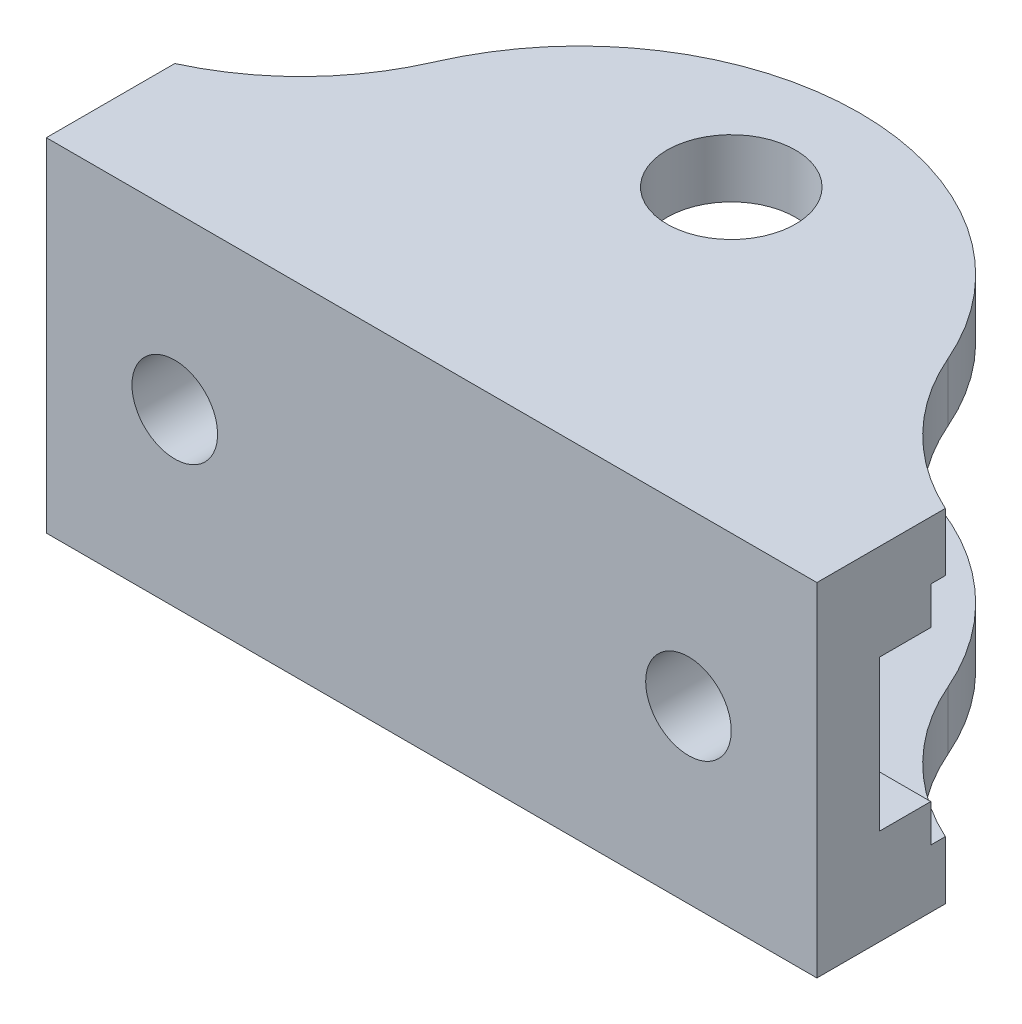
ISO-10303-21;
HEADER;
FILE_DESCRIPTION(('STEP AP214'),'2;1');
FILE_NAME('part.step','',(''),(''),'','','');
FILE_SCHEMA(('AUTOMOTIVE_DESIGN { 1 0 10303 214 1 1 1 1 }'));
ENDSEC;
DATA;
#1=APPLICATION_CONTEXT('core data for automotive mechanical design processes');
#2=APPLICATION_PROTOCOL_DEFINITION('international standard','automotive_design',2000,#1);
#3=PRODUCT_CONTEXT('',#1,'mechanical');
#4=PRODUCT('Part','Part','',(#3));
#5=PRODUCT_RELATED_PRODUCT_CATEGORY('part','',(#4));
#6=PRODUCT_DEFINITION_FORMATION('','',#4);
#7=PRODUCT_DEFINITION_CONTEXT('part definition',#1,'design');
#8=PRODUCT_DEFINITION('design','',#6,#7);
#9=PRODUCT_DEFINITION_SHAPE('','',#8);
#10=(LENGTH_UNIT() NAMED_UNIT(*) SI_UNIT(.MILLI.,.METRE.));
#11=(NAMED_UNIT(*) PLANE_ANGLE_UNIT() SI_UNIT($,.RADIAN.));
#12=(NAMED_UNIT(*) SI_UNIT($,.STERADIAN.) SOLID_ANGLE_UNIT());
#13=UNCERTAINTY_MEASURE_WITH_UNIT(LENGTH_MEASURE(1.E-05),#10,'distance_accuracy_value','');
#14=(GEOMETRIC_REPRESENTATION_CONTEXT(3) GLOBAL_UNCERTAINTY_ASSIGNED_CONTEXT((#13)) GLOBAL_UNIT_ASSIGNED_CONTEXT((#10,
#11,#12)) REPRESENTATION_CONTEXT('',''));
#15=CARTESIAN_POINT('',(0.,0.,0.));
#16=DIRECTION('',(0.,0.,1.));
#17=DIRECTION('',(1.,0.,0.));
#18=AXIS2_PLACEMENT_3D('',#15,#16,#17);
#19=CARTESIAN_POINT('',(-28.575,12.7,-38.1));
#20=DIRECTION('',(1.,0.,0.));
#21=DIRECTION('',(0.,0.,1.));
#22=AXIS2_PLACEMENT_3D('',#19,#20,#21);
#23=PLANE('',#22);
#24=DIRECTION('',(0.,1.,0.));
#25=VECTOR('',#24,1.);
#26=CARTESIAN_POINT('',(-28.575,-12.7000000000001,-9.525));
#27=LINE('',#26,#25);
#28=CARTESIAN_POINT('',(-28.575,8.382,-9.525));
#29=VERTEX_POINT('',#28);
#30=CARTESIAN_POINT('',(-28.575,12.6999999999999,-9.525));
#31=VERTEX_POINT('',#30);
#32=EDGE_CURVE('E154',#29,#31,#27,.T.);
#33=ORIENTED_EDGE('',*,*,#32,.F.);
#34=DIRECTION('',(0.,0.,-1.));
#35=VECTOR('',#34,1.);
#36=CARTESIAN_POINT('',(-28.575,8.382,54.9224901944315));
#37=LINE('',#36,#35);
#38=CARTESIAN_POINT('',(-28.575,8.382,-8.4455));
#39=VERTEX_POINT('',#38);
#40=EDGE_CURVE('E217',#39,#29,#37,.T.);
#41=ORIENTED_EDGE('',*,*,#40,.F.);
#42=DIRECTION('',(0.,-1.,0.));
#43=VECTOR('',#42,1.);
#44=CARTESIAN_POINT('',(-28.575,8.382,-8.4455));
#45=LINE('',#44,#43);
#46=CARTESIAN_POINT('',(-28.575,5.588,-8.44549999999997));
#47=VERTEX_POINT('',#46);
#48=EDGE_CURVE('E210',#39,#47,#45,.T.);
#49=ORIENTED_EDGE('',*,*,#48,.T.);
#50=DIRECTION('',(0.,0.,-1.));
#51=VECTOR('',#50,1.);
#52=CARTESIAN_POINT('',(-28.575,5.588,58.2325121903563));
#53=LINE('',#52,#51);
#54=CARTESIAN_POINT('',(-28.575,5.588,-4.63549999999999));
#55=VERTEX_POINT('',#54);
#56=EDGE_CURVE('E239',#55,#47,#53,.T.);
#57=ORIENTED_EDGE('',*,*,#56,.F.);
#58=DIRECTION('',(0.,-1.,0.));
#59=VECTOR('',#58,1.);
#60=CARTESIAN_POINT('',(-28.575,5.588,-4.63549999999999));
#61=LINE('',#60,#59);
#62=CARTESIAN_POINT('',(-28.575,-5.588,-4.63549999999999));
#63=VERTEX_POINT('',#62);
#64=EDGE_CURVE('E235',#55,#63,#61,.T.);
#65=ORIENTED_EDGE('',*,*,#64,.T.);
#66=DIRECTION('',(0.,0.,-1.));
#67=VECTOR('',#66,1.);
#68=CARTESIAN_POINT('',(-28.575,-5.588,58.2325121903563));
#69=LINE('',#68,#67);
#70=CARTESIAN_POINT('',(-28.575,-5.588,-8.4455));
#71=VERTEX_POINT('',#70);
#72=EDGE_CURVE('E238',#63,#71,#69,.T.);
#73=ORIENTED_EDGE('',*,*,#72,.T.);
#74=CARTESIAN_POINT('',(-28.575,-8.382,-8.4455));
#75=VERTEX_POINT('',#74);
#76=EDGE_CURVE('E214',#71,#75,#45,.T.);
#77=ORIENTED_EDGE('',*,*,#76,.T.);
#78=DIRECTION('',(0.,0.,-1.));
#79=VECTOR('',#78,1.);
#80=CARTESIAN_POINT('',(-28.575,-8.382,54.9224901944315));
#81=LINE('',#80,#79);
#82=CARTESIAN_POINT('',(-28.575,-8.382,-9.525));
#83=VERTEX_POINT('',#82);
#84=EDGE_CURVE('E213',#75,#83,#81,.T.);
#85=ORIENTED_EDGE('',*,*,#84,.T.);
#86=CARTESIAN_POINT('',(-28.575,-12.7000000000001,-9.525));
#87=VERTEX_POINT('',#86);
#88=EDGE_CURVE('E188',#87,#83,#27,.T.);
#89=ORIENTED_EDGE('',*,*,#88,.F.);
#90=DIRECTION('',(0.,0.,1.));
#91=VECTOR('',#90,1.);
#92=CARTESIAN_POINT('',(-28.575,-12.7,-38.1));
#93=LINE('',#92,#91);
#94=CARTESIAN_POINT('',(-28.575,-12.7,0.));
#95=VERTEX_POINT('',#94);
#96=EDGE_CURVE('E168',#87,#95,#93,.T.);
#97=ORIENTED_EDGE('',*,*,#96,.T.);
#98=DIRECTION('',(0.,-1.,0.));
#99=VECTOR('',#98,1.);
#100=CARTESIAN_POINT('',(-28.575,12.7,0.));
#101=LINE('',#100,#99);
#102=CARTESIAN_POINT('',(-28.575,12.7,0.));
#103=VERTEX_POINT('',#102);
#104=EDGE_CURVE('E264',#103,#95,#101,.T.);
#105=ORIENTED_EDGE('',*,*,#104,.F.);
#106=DIRECTION('',(0.,0.,1.));
#107=VECTOR('',#106,1.);
#108=CARTESIAN_POINT('',(-28.575,12.7,-38.1));
#109=LINE('',#108,#107);
#110=EDGE_CURVE('E280',#31,#103,#109,.T.);
#111=ORIENTED_EDGE('',*,*,#110,.F.);
#112=EDGE_LOOP('',(#33,#41,#49,#57,#65,#73,#77,#85,#89,#97,#105,#111));
#113=FACE_BOUND('',#112,.T.);
#114=ADVANCED_FACE('F36',(#113),#23,.F.);
#115=CARTESIAN_POINT('',(28.575,12.7,0.));
#116=DIRECTION('',(0.,0.,1.));
#117=DIRECTION('',(-1.,0.,0.));
#118=AXIS2_PLACEMENT_3D('',#115,#116,#117);
#119=PLANE('',#118);
#120=CARTESIAN_POINT('',(19.05,0.,0.));
#121=DIRECTION('',(0.,0.,1.));
#122=DIRECTION('',(1.,0.,0.));
#123=AXIS2_PLACEMENT_3D('',#120,#121,#122);
#124=CIRCLE('',#123,3.175);
#125=CARTESIAN_POINT('',(15.875,0.,0.));
#126=VERTEX_POINT('',#125);
#127=EDGE_CURVE('E261',#126,#126,#124,.T.);
#128=ORIENTED_EDGE('',*,*,#127,.F.);
#129=EDGE_LOOP('',(#128));
#130=FACE_BOUND('',#129,.T.);
#131=ORIENTED_EDGE('',*,*,#104,.T.);
#132=DIRECTION('',(1.,0.,0.));
#133=VECTOR('',#132,1.);
#134=CARTESIAN_POINT('',(28.575,-12.7,0.));
#135=LINE('',#134,#133);
#136=CARTESIAN_POINT('',(28.575,-12.7,0.));
#137=VERTEX_POINT('',#136);
#138=EDGE_CURVE('E267',#95,#137,#135,.T.);
#139=ORIENTED_EDGE('',*,*,#138,.T.);
#140=DIRECTION('',(0.,1.,0.));
#141=VECTOR('',#140,1.);
#142=CARTESIAN_POINT('',(28.575,12.7,0.));
#143=LINE('',#142,#141);
#144=CARTESIAN_POINT('',(28.575,12.7,0.));
#145=VERTEX_POINT('',#144);
#146=EDGE_CURVE('E270',#137,#145,#143,.T.);
#147=ORIENTED_EDGE('',*,*,#146,.T.);
#148=DIRECTION('',(-1.,0.,0.));
#149=VECTOR('',#148,1.);
#150=CARTESIAN_POINT('',(22.225,12.7,0.));
#151=LINE('',#150,#149);
#152=EDGE_CURVE('E273',#145,#103,#151,.T.);
#153=ORIENTED_EDGE('',*,*,#152,.T.);
#154=EDGE_LOOP('',(#131,#139,#147,#153));
#155=FACE_BOUND('',#154,.T.);
#156=CARTESIAN_POINT('',(-19.05,0.,0.));
#157=DIRECTION('',(0.,0.,1.));
#158=DIRECTION('',(1.,0.,0.));
#159=AXIS2_PLACEMENT_3D('',#156,#157,#158);
#160=CIRCLE('',#159,3.175);
#161=CARTESIAN_POINT('',(-22.225,0.,0.));
#162=VERTEX_POINT('',#161);
#163=EDGE_CURVE('E258',#162,#162,#160,.T.);
#164=ORIENTED_EDGE('',*,*,#163,.F.);
#165=EDGE_LOOP('',(#164));
#166=FACE_BOUND('',#165,.T.);
#167=ADVANCED_FACE('F304',(#130,#155,#166),#119,.T.);
#168=CARTESIAN_POINT('',(28.575,-12.7,-38.1));
#169=DIRECTION('',(0.,1.,0.));
#170=DIRECTION('',(-1.,0.,0.));
#171=AXIS2_PLACEMENT_3D('',#168,#169,#170);
#172=PLANE('',#171);
#173=CARTESIAN_POINT('',(0.,-12.7,-22.225));
#174=DIRECTION('',(0.,-1.,0.));
#175=DIRECTION('',(-1.,0.,0.));
#176=AXIS2_PLACEMENT_3D('',#173,#174,#175);
#177=CIRCLE('',#176,4.7625);
#178=CARTESIAN_POINT('',(-4.76249999999999,-12.7,-22.225));
#179=VERTEX_POINT('',#178);
#180=EDGE_CURVE('E198',#179,#179,#177,.T.);
#181=ORIENTED_EDGE('',*,*,#180,.F.);
#182=EDGE_LOOP('',(#181));
#183=FACE_BOUND('',#182,.T.);
#184=DIRECTION('',(0.,0.,1.));
#185=VECTOR('',#184,1.);
#186=CARTESIAN_POINT('',(28.575,-12.7,-38.1));
#187=LINE('',#186,#185);
#188=CARTESIAN_POINT('',(28.575,-12.7,-9.525));
#189=VERTEX_POINT('',#188);
#190=EDGE_CURVE('E277',#189,#137,#187,.T.);
#191=ORIENTED_EDGE('',*,*,#190,.T.);
#192=ORIENTED_EDGE('',*,*,#138,.F.);
#193=ORIENTED_EDGE('',*,*,#96,.F.);
#194=CARTESIAN_POINT('',(-36.5247503499917,-12.7000000000001,-26.8369602983835));
#195=DIRECTION('',(0.,-1.,0.));
#196=DIRECTION('',(-1.,0.,0.));
#197=AXIS2_PLACEMENT_3D('',#194,#195,#196);
#198=CIRCLE('',#197,19.05);
#199=CARTESIAN_POINT('',(-19.05,-12.7000000000001,-19.2517378095262));
#200=VERTEX_POINT('',#199);
#201=EDGE_CURVE('E150',#87,#200,#198,.F.);
#202=ORIENTED_EDGE('',*,*,#201,.T.);
#203=CARTESIAN_POINT('',(0.,-12.7000000000001,-10.9827505268095));
#204=DIRECTION('',(0.,-1.,0.));
#205=DIRECTION('',(-1.,0.,0.));
#206=AXIS2_PLACEMENT_3D('',#203,#204,#205);
#207=CIRCLE('',#206,20.7672494731905);
#208=CARTESIAN_POINT('',(19.05,-12.7000000000001,-19.2517378095262));
#209=VERTEX_POINT('',#208);
#210=EDGE_CURVE('E158',#200,#209,#207,.T.);
#211=ORIENTED_EDGE('',*,*,#210,.T.);
#212=CARTESIAN_POINT('',(36.5247503499917,-12.7,-26.8369602983835));
#213=DIRECTION('',(0.,-1.,0.));
#214=DIRECTION('',(-1.,0.,0.));
#215=AXIS2_PLACEMENT_3D('',#212,#213,#214);
#216=CIRCLE('',#215,19.05);
#217=EDGE_CURVE('E170',#189,#209,#216,.T.);
#218=ORIENTED_EDGE('',*,*,#217,.F.);
#219=EDGE_LOOP('',(#191,#192,#193,#202,#211,#218));
#220=FACE_BOUND('',#219,.T.);
#221=ADVANCED_FACE('F166',(#183,#220),#172,.F.);
#222=CARTESIAN_POINT('',(28.575,12.7,-38.1));
#223=DIRECTION('',(-1.,0.,0.));
#224=DIRECTION('',(0.,0.,-1.));
#225=AXIS2_PLACEMENT_3D('',#222,#223,#224);
#226=PLANE('',#225);
#227=DIRECTION('',(0.,0.,1.));
#228=VECTOR('',#227,1.);
#229=CARTESIAN_POINT('',(28.575,12.7,-38.1));
#230=LINE('',#229,#228);
#231=CARTESIAN_POINT('',(28.575,12.7,-9.525));
#232=VERTEX_POINT('',#231);
#233=EDGE_CURVE('E275',#232,#145,#230,.T.);
#234=ORIENTED_EDGE('',*,*,#233,.T.);
#235=ORIENTED_EDGE('',*,*,#146,.F.);
#236=ORIENTED_EDGE('',*,*,#190,.F.);
#237=DIRECTION('',(0.,1.,0.));
#238=VECTOR('',#237,1.);
#239=CARTESIAN_POINT('',(28.575,-12.7,-9.525));
#240=LINE('',#239,#238);
#241=CARTESIAN_POINT('',(28.575,-8.38199999999999,-9.525));
#242=VERTEX_POINT('',#241);
#243=EDGE_CURVE('E184',#189,#242,#240,.T.);
#244=ORIENTED_EDGE('',*,*,#243,.T.);
#245=DIRECTION('',(0.,0.,-1.));
#246=VECTOR('',#245,1.);
#247=CARTESIAN_POINT('',(28.575,-8.38199999999999,54.9224901944315));
#248=LINE('',#247,#246);
#249=CARTESIAN_POINT('',(28.575,-8.38199999999999,-8.44549999999997));
#250=VERTEX_POINT('',#249);
#251=EDGE_CURVE('E209',#250,#242,#248,.T.);
#252=ORIENTED_EDGE('',*,*,#251,.F.);
#253=DIRECTION('',(0.,1.,0.));
#254=VECTOR('',#253,1.);
#255=CARTESIAN_POINT('',(28.575,8.38199999999999,-8.4455));
#256=LINE('',#255,#254);
#257=CARTESIAN_POINT('',(28.575,-5.58799999999999,-8.44549999999997));
#258=VERTEX_POINT('',#257);
#259=EDGE_CURVE('E219',#250,#258,#256,.T.);
#260=ORIENTED_EDGE('',*,*,#259,.T.);
#261=DIRECTION('',(0.,0.,-1.));
#262=VECTOR('',#261,1.);
#263=CARTESIAN_POINT('',(28.575,-5.58799999999999,58.2325121903563));
#264=LINE('',#263,#262);
#265=CARTESIAN_POINT('',(28.575,-5.58799999999999,-4.63549999999999));
#266=VERTEX_POINT('',#265);
#267=EDGE_CURVE('E234',#266,#258,#264,.T.);
#268=ORIENTED_EDGE('',*,*,#267,.F.);
#269=DIRECTION('',(0.,1.,0.));
#270=VECTOR('',#269,1.);
#271=CARTESIAN_POINT('',(28.575,5.58799999999999,-4.63549999999999));
#272=LINE('',#271,#270);
#273=CARTESIAN_POINT('',(28.575,5.58799999999999,-4.63549999999999));
#274=VERTEX_POINT('',#273);
#275=EDGE_CURVE('E243',#266,#274,#272,.T.);
#276=ORIENTED_EDGE('',*,*,#275,.T.);
#277=DIRECTION('',(0.,0.,-1.));
#278=VECTOR('',#277,1.);
#279=CARTESIAN_POINT('',(28.575,5.58799999999999,58.2325121903563));
#280=LINE('',#279,#278);
#281=CARTESIAN_POINT('',(28.575,5.58799999999999,-8.4455));
#282=VERTEX_POINT('',#281);
#283=EDGE_CURVE('E242',#274,#282,#280,.T.);
#284=ORIENTED_EDGE('',*,*,#283,.T.);
#285=CARTESIAN_POINT('',(28.575,8.38199999999999,-8.4455));
#286=VERTEX_POINT('',#285);
#287=EDGE_CURVE('E222',#282,#286,#256,.T.);
#288=ORIENTED_EDGE('',*,*,#287,.T.);
#289=DIRECTION('',(0.,0.,-1.));
#290=VECTOR('',#289,1.);
#291=CARTESIAN_POINT('',(28.575,8.38199999999999,54.9224901944315));
#292=LINE('',#291,#290);
#293=CARTESIAN_POINT('',(28.575,8.38199999999999,-9.525));
#294=VERTEX_POINT('',#293);
#295=EDGE_CURVE('E218',#286,#294,#292,.T.);
#296=ORIENTED_EDGE('',*,*,#295,.T.);
#297=EDGE_CURVE('E187',#294,#232,#240,.T.);
#298=ORIENTED_EDGE('',*,*,#297,.T.);
#299=EDGE_LOOP('',(#234,#235,#236,#244,#252,#260,#268,#276,#284,#288,#296,#298));
#300=FACE_BOUND('',#299,.T.);
#301=ADVANCED_FACE('F299',(#300),#226,.F.);
#302=CARTESIAN_POINT('',(22.225,12.7,-38.1));
#303=DIRECTION('',(0.,-1.,0.));
#304=DIRECTION('',(1.,0.,0.));
#305=AXIS2_PLACEMENT_3D('',#302,#303,#304);
#306=PLANE('',#305);
#307=CARTESIAN_POINT('',(0.,12.7,-22.225));
#308=DIRECTION('',(0.,-1.,0.));
#309=DIRECTION('',(-1.,0.,0.));
#310=AXIS2_PLACEMENT_3D('',#307,#308,#309);
#311=CIRCLE('',#310,4.7625);
#312=CARTESIAN_POINT('',(-4.76250000000001,12.7,-22.225));
#313=VERTEX_POINT('',#312);
#314=EDGE_CURVE('E197',#313,#313,#311,.T.);
#315=ORIENTED_EDGE('',*,*,#314,.T.);
#316=EDGE_LOOP('',(#315));
#317=FACE_BOUND('',#316,.T.);
#318=CARTESIAN_POINT('',(0.,12.7,-10.9827505268095));
#319=DIRECTION('',(0.,-1.,0.));
#320=DIRECTION('',(-1.,0.,0.));
#321=AXIS2_PLACEMENT_3D('',#318,#319,#320);
#322=CIRCLE('',#321,20.7672494731905);
#323=CARTESIAN_POINT('',(-19.05,12.7,-19.2517378095262));
#324=VERTEX_POINT('',#323);
#325=CARTESIAN_POINT('',(19.05,12.7,-19.2517378095262));
#326=VERTEX_POINT('',#325);
#327=EDGE_CURVE('E174',#324,#326,#322,.T.);
#328=ORIENTED_EDGE('',*,*,#327,.F.);
#329=CARTESIAN_POINT('',(-36.5247503499917,12.6999999999999,-26.8369602983835));
#330=DIRECTION('',(0.,-1.,0.));
#331=DIRECTION('',(-1.,0.,0.));
#332=AXIS2_PLACEMENT_3D('',#329,#330,#331);
#333=CIRCLE('',#332,19.05);
#334=EDGE_CURVE('E177',#31,#324,#333,.F.);
#335=ORIENTED_EDGE('',*,*,#334,.F.);
#336=ORIENTED_EDGE('',*,*,#110,.T.);
#337=ORIENTED_EDGE('',*,*,#152,.F.);
#338=ORIENTED_EDGE('',*,*,#233,.F.);
#339=CARTESIAN_POINT('',(36.5247503499917,12.7,-26.8369602983835));
#340=DIRECTION('',(0.,-1.,0.));
#341=DIRECTION('',(-1.,0.,0.));
#342=AXIS2_PLACEMENT_3D('',#339,#340,#341);
#343=CIRCLE('',#342,19.05);
#344=EDGE_CURVE('E164',#232,#326,#343,.T.);
#345=ORIENTED_EDGE('',*,*,#344,.T.);
#346=EDGE_LOOP('',(#328,#335,#336,#337,#338,#345));
#347=FACE_BOUND('',#346,.T.);
#348=ADVANCED_FACE('F342',(#317,#347),#306,.F.);
#349=CARTESIAN_POINT('',(19.05,0.,-38.1));
#350=DIRECTION('',(0.,0.,1.));
#351=DIRECTION('',(-1.,0.,0.));
#352=AXIS2_PLACEMENT_3D('',#349,#350,#351);
#353=CYLINDRICAL_SURFACE('',#352,3.175);
#354=CARTESIAN_POINT('',(19.05,0.,-4.6355));
#355=DIRECTION('',(0.,0.,-1.));
#356=DIRECTION('',(-1.,0.,0.));
#357=AXIS2_PLACEMENT_3D('',#354,#355,#356);
#358=CIRCLE('',#357,3.175);
#359=CARTESIAN_POINT('',(15.875,0.,-4.6355));
#360=VERTEX_POINT('',#359);
#361=EDGE_CURVE('E255',#360,#360,#358,.T.);
#362=CARTESIAN_POINT('',(15.875,0.,-4.6355));
#363=CARTESIAN_POINT('',(15.875,0.,-4.58721354166667));
#364=CARTESIAN_POINT('',(15.875,0.,-4.53892708333333));
#365=CARTESIAN_POINT('',(15.875,0.,-4.44235416666667));
#366=CARTESIAN_POINT('',(15.875,0.,-4.39406770833333));
#367=CARTESIAN_POINT('',(15.875,0.,-4.29749479166667));
#368=CARTESIAN_POINT('',(15.875,0.,-4.24920833333333));
#369=CARTESIAN_POINT('',(15.875,0.,-4.15263541666667));
#370=CARTESIAN_POINT('',(15.875,0.,-4.10434895833333));
#371=CARTESIAN_POINT('',(15.875,0.,-4.00777604166667));
#372=CARTESIAN_POINT('',(15.875,0.,-3.95948958333333));
#373=CARTESIAN_POINT('',(15.875,0.,-3.86291666666667));
#374=CARTESIAN_POINT('',(15.875,0.,-3.81463020833333));
#375=CARTESIAN_POINT('',(15.875,0.,-3.71805729166666));
#376=CARTESIAN_POINT('',(15.875,0.,-3.66977083333333));
#377=CARTESIAN_POINT('',(15.875,0.,-3.57319791666666));
#378=CARTESIAN_POINT('',(15.875,0.,-3.52491145833333));
#379=CARTESIAN_POINT('',(15.875,0.,-3.42833854166667));
#380=CARTESIAN_POINT('',(15.875,0.,-3.38005208333333));
#381=CARTESIAN_POINT('',(15.875,0.,-3.28347916666667));
#382=CARTESIAN_POINT('',(15.875,0.,-3.23519270833334));
#383=CARTESIAN_POINT('',(15.875,0.,-3.13861979166667));
#384=CARTESIAN_POINT('',(15.875,0.,-3.09033333333334));
#385=CARTESIAN_POINT('',(15.875,0.,-2.99376041666667));
#386=CARTESIAN_POINT('',(15.875,0.,-2.94547395833334));
#387=CARTESIAN_POINT('',(15.875,0.,-2.84890104166667));
#388=CARTESIAN_POINT('',(15.875,0.,-2.80061458333333));
#389=CARTESIAN_POINT('',(15.875,0.,-2.70404166666667));
#390=CARTESIAN_POINT('',(15.875,0.,-2.65575520833333));
#391=CARTESIAN_POINT('',(15.875,0.,-2.55918229166667));
#392=CARTESIAN_POINT('',(15.875,0.,-2.51089583333333));
#393=CARTESIAN_POINT('',(15.875,0.,-2.41432291666667));
#394=CARTESIAN_POINT('',(15.875,0.,-2.36603645833333));
#395=CARTESIAN_POINT('',(15.875,0.,-2.26946354166667));
#396=CARTESIAN_POINT('',(15.875,0.,-2.22117708333333));
#397=CARTESIAN_POINT('',(15.875,0.,-2.12460416666667));
#398=CARTESIAN_POINT('',(15.875,0.,-2.07631770833333));
#399=CARTESIAN_POINT('',(15.875,0.,-1.97974479166667));
#400=CARTESIAN_POINT('',(15.875,0.,-1.93145833333333));
#401=CARTESIAN_POINT('',(15.875,0.,-1.83488541666667));
#402=CARTESIAN_POINT('',(15.875,0.,-1.78659895833333));
#403=CARTESIAN_POINT('',(15.875,0.,-1.69002604166667));
#404=CARTESIAN_POINT('',(15.875,0.,-1.64173958333333));
#405=CARTESIAN_POINT('',(15.875,0.,-1.54516666666666));
#406=CARTESIAN_POINT('',(15.875,0.,-1.49688020833333));
#407=CARTESIAN_POINT('',(15.875,0.,-1.40030729166666));
#408=CARTESIAN_POINT('',(15.875,0.,-1.35202083333333));
#409=CARTESIAN_POINT('',(15.875,0.,-1.25544791666667));
#410=CARTESIAN_POINT('',(15.875,0.,-1.20716145833333));
#411=CARTESIAN_POINT('',(15.875,0.,-1.11058854166667));
#412=CARTESIAN_POINT('',(15.875,0.,-1.06230208333334));
#413=CARTESIAN_POINT('',(15.875,0.,-0.96572916666667));
#414=CARTESIAN_POINT('',(15.875,0.,-0.917442708333336));
#415=CARTESIAN_POINT('',(15.875,0.,-0.820869791666669));
#416=CARTESIAN_POINT('',(15.875,0.,-0.772583333333336));
#417=CARTESIAN_POINT('',(15.875,0.,-0.676010416666669));
#418=CARTESIAN_POINT('',(15.875,0.,-0.627723958333335));
#419=CARTESIAN_POINT('',(15.875,0.,-0.531151041666668));
#420=CARTESIAN_POINT('',(15.875,0.,-0.482864583333335));
#421=CARTESIAN_POINT('',(15.875,0.,-0.386291666666668));
#422=CARTESIAN_POINT('',(15.875,0.,-0.338005208333334));
#423=CARTESIAN_POINT('',(15.875,0.,-0.241432291666667));
#424=CARTESIAN_POINT('',(15.875,0.,-0.193145833333334));
#425=CARTESIAN_POINT('',(15.875,0.,-0.096572916666667));
#426=CARTESIAN_POINT('',(15.875,0.,-0.0482864583333335));
#427=CARTESIAN_POINT('',(15.875,0.,0.));
#428=B_SPLINE_CURVE_WITH_KNOTS('',3,(#362,#363,#364,#365,#366,#367,#368,#369,#370,#371,#372,
#373,#374,#375,#376,#377,#378,#379,#380,#381,#382,#383,#384,#385,#386,#387,#388,#389,#390,#391,
#392,#393,#394,#395,#396,#397,#398,#399,#400,#401,#402,#403,#404,#405,#406,#407,#408,#409,#410,
#411,#412,#413,#414,#415,#416,#417,#418,#419,#420,#421,#422,#423,#424,#425,#426,#427),
.UNSPECIFIED.,.F.,.F.,(4,2,2,2,2,2,2,2,2,2,2,2,2,2,2,2,2,2,2,2,2,2,2,2,2,2,2,2,2,2,2,2,4),(0.,
0.144859375,0.289718750000001,0.434578125000001,0.579437500000002,0.724296875000002,
0.869156250000003,1.014015625,1.158875,1.303734375,1.44859375,1.593453125,1.7383125,1.883171875,
2.02803125,2.172890625,2.31775,2.462609375,2.60746875,2.752328125,2.8971875,3.042046875,
3.18690625,3.331765625,3.476625,3.621484375,3.76634375,3.911203125,4.0560625,4.200921875,
4.34578125,4.490640625,4.6355),.UNSPECIFIED.);
#429=EDGE_CURVE('BSEAM368',#360,#126,#428,.T.);
#430=ORIENTED_EDGE('',*,*,#361,.T.);
#431=ORIENTED_EDGE('',*,*,#127,.T.);
#432=ORIENTED_EDGE('',*,*,#429,.T.);
#433=ORIENTED_EDGE('',*,*,#429,.F.);
#434=EDGE_LOOP('',(#430,#432,#431,#433));
#435=FACE_BOUND('',#434,.T.);
#436=ADVANCED_FACE('F368',(#435),#353,.F.);
#437=CARTESIAN_POINT('',(-19.05,0.,-38.1));
#438=DIRECTION('',(0.,0.,1.));
#439=DIRECTION('',(-1.,0.,0.));
#440=AXIS2_PLACEMENT_3D('',#437,#438,#439);
#441=CYLINDRICAL_SURFACE('',#440,3.175);
#442=CARTESIAN_POINT('',(-19.05,0.,-4.6355));
#443=DIRECTION('',(0.,0.,-1.));
#444=DIRECTION('',(-1.,0.,0.));
#445=AXIS2_PLACEMENT_3D('',#442,#443,#444);
#446=CIRCLE('',#445,3.175);
#447=CARTESIAN_POINT('',(-22.225,0.,-4.6355));
#448=VERTEX_POINT('',#447);
#449=EDGE_CURVE('E254',#448,#448,#446,.T.);
#450=CARTESIAN_POINT('',(-22.225,0.,-4.6355));
#451=CARTESIAN_POINT('',(-22.225,0.,-4.58721354166667));
#452=CARTESIAN_POINT('',(-22.225,0.,-4.53892708333333));
#453=CARTESIAN_POINT('',(-22.225,0.,-4.44235416666667));
#454=CARTESIAN_POINT('',(-22.225,0.,-4.39406770833333));
#455=CARTESIAN_POINT('',(-22.225,0.,-4.29749479166667));
#456=CARTESIAN_POINT('',(-22.225,0.,-4.24920833333333));
#457=CARTESIAN_POINT('',(-22.225,0.,-4.15263541666667));
#458=CARTESIAN_POINT('',(-22.225,0.,-4.10434895833333));
#459=CARTESIAN_POINT('',(-22.225,0.,-4.00777604166667));
#460=CARTESIAN_POINT('',(-22.225,0.,-3.95948958333333));
#461=CARTESIAN_POINT('',(-22.225,0.,-3.86291666666667));
#462=CARTESIAN_POINT('',(-22.225,0.,-3.81463020833333));
#463=CARTESIAN_POINT('',(-22.225,0.,-3.71805729166666));
#464=CARTESIAN_POINT('',(-22.225,0.,-3.66977083333333));
#465=CARTESIAN_POINT('',(-22.225,0.,-3.57319791666666));
#466=CARTESIAN_POINT('',(-22.225,0.,-3.52491145833333));
#467=CARTESIAN_POINT('',(-22.225,0.,-3.42833854166667));
#468=CARTESIAN_POINT('',(-22.225,0.,-3.38005208333333));
#469=CARTESIAN_POINT('',(-22.225,0.,-3.28347916666667));
#470=CARTESIAN_POINT('',(-22.225,0.,-3.23519270833334));
#471=CARTESIAN_POINT('',(-22.225,0.,-3.13861979166667));
#472=CARTESIAN_POINT('',(-22.225,0.,-3.09033333333334));
#473=CARTESIAN_POINT('',(-22.225,0.,-2.99376041666667));
#474=CARTESIAN_POINT('',(-22.225,0.,-2.94547395833334));
#475=CARTESIAN_POINT('',(-22.225,0.,-2.84890104166667));
#476=CARTESIAN_POINT('',(-22.225,0.,-2.80061458333333));
#477=CARTESIAN_POINT('',(-22.225,0.,-2.70404166666667));
#478=CARTESIAN_POINT('',(-22.225,0.,-2.65575520833333));
#479=CARTESIAN_POINT('',(-22.225,0.,-2.55918229166667));
#480=CARTESIAN_POINT('',(-22.225,0.,-2.51089583333333));
#481=CARTESIAN_POINT('',(-22.225,0.,-2.41432291666667));
#482=CARTESIAN_POINT('',(-22.225,0.,-2.36603645833333));
#483=CARTESIAN_POINT('',(-22.225,0.,-2.26946354166667));
#484=CARTESIAN_POINT('',(-22.225,0.,-2.22117708333333));
#485=CARTESIAN_POINT('',(-22.225,0.,-2.12460416666667));
#486=CARTESIAN_POINT('',(-22.225,0.,-2.07631770833333));
#487=CARTESIAN_POINT('',(-22.225,0.,-1.97974479166667));
#488=CARTESIAN_POINT('',(-22.225,0.,-1.93145833333333));
#489=CARTESIAN_POINT('',(-22.225,0.,-1.83488541666667));
#490=CARTESIAN_POINT('',(-22.225,0.,-1.78659895833333));
#491=CARTESIAN_POINT('',(-22.225,0.,-1.69002604166667));
#492=CARTESIAN_POINT('',(-22.225,0.,-1.64173958333333));
#493=CARTESIAN_POINT('',(-22.225,0.,-1.54516666666666));
#494=CARTESIAN_POINT('',(-22.225,0.,-1.49688020833333));
#495=CARTESIAN_POINT('',(-22.225,0.,-1.40030729166666));
#496=CARTESIAN_POINT('',(-22.225,0.,-1.35202083333333));
#497=CARTESIAN_POINT('',(-22.225,0.,-1.25544791666667));
#498=CARTESIAN_POINT('',(-22.225,0.,-1.20716145833333));
#499=CARTESIAN_POINT('',(-22.225,0.,-1.11058854166667));
#500=CARTESIAN_POINT('',(-22.225,0.,-1.06230208333334));
#501=CARTESIAN_POINT('',(-22.225,0.,-0.96572916666667));
#502=CARTESIAN_POINT('',(-22.225,0.,-0.917442708333336));
#503=CARTESIAN_POINT('',(-22.225,0.,-0.820869791666669));
#504=CARTESIAN_POINT('',(-22.225,0.,-0.772583333333336));
#505=CARTESIAN_POINT('',(-22.225,0.,-0.676010416666669));
#506=CARTESIAN_POINT('',(-22.225,0.,-0.627723958333335));
#507=CARTESIAN_POINT('',(-22.225,0.,-0.531151041666668));
#508=CARTESIAN_POINT('',(-22.225,0.,-0.482864583333335));
#509=CARTESIAN_POINT('',(-22.225,0.,-0.386291666666668));
#510=CARTESIAN_POINT('',(-22.225,0.,-0.338005208333334));
#511=CARTESIAN_POINT('',(-22.225,0.,-0.241432291666667));
#512=CARTESIAN_POINT('',(-22.225,0.,-0.193145833333334));
#513=CARTESIAN_POINT('',(-22.225,0.,-0.096572916666667));
#514=CARTESIAN_POINT('',(-22.225,0.,-0.0482864583333335));
#515=CARTESIAN_POINT('',(-22.225,0.,0.));
#516=B_SPLINE_CURVE_WITH_KNOTS('',3,(#450,#451,#452,#453,#454,#455,#456,#457,#458,#459,#460,
#461,#462,#463,#464,#465,#466,#467,#468,#469,#470,#471,#472,#473,#474,#475,#476,#477,#478,#479,
#480,#481,#482,#483,#484,#485,#486,#487,#488,#489,#490,#491,#492,#493,#494,#495,#496,#497,#498,
#499,#500,#501,#502,#503,#504,#505,#506,#507,#508,#509,#510,#511,#512,#513,#514,#515),
.UNSPECIFIED.,.F.,.F.,(4,2,2,2,2,2,2,2,2,2,2,2,2,2,2,2,2,2,2,2,2,2,2,2,2,2,2,2,2,2,2,2,4),(0.,
0.144859375,0.289718750000001,0.434578125000001,0.579437500000002,0.724296875000002,
0.869156250000003,1.014015625,1.158875,1.303734375,1.44859375,1.593453125,1.7383125,1.883171875,
2.02803125,2.172890625,2.31775,2.462609375,2.60746875,2.752328125,2.8971875,3.042046875,
3.18690625,3.331765625,3.476625,3.621484375,3.76634375,3.911203125,4.0560625,4.200921875,
4.34578125,4.490640625,4.6355),.UNSPECIFIED.);
#517=EDGE_CURVE('BSEAM388',#448,#162,#516,.T.);
#518=ORIENTED_EDGE('',*,*,#449,.T.);
#519=ORIENTED_EDGE('',*,*,#163,.T.);
#520=ORIENTED_EDGE('',*,*,#517,.T.);
#521=ORIENTED_EDGE('',*,*,#517,.F.);
#522=EDGE_LOOP('',(#518,#520,#519,#521));
#523=FACE_BOUND('',#522,.T.);
#524=ADVANCED_FACE('F388',(#523),#441,.F.);
#525=CARTESIAN_POINT('',(28.575,12.7,-4.6355));
#526=DIRECTION('',(0.,0.,1.));
#527=DIRECTION('',(-1.,0.,0.));
#528=AXIS2_PLACEMENT_3D('',#525,#526,#527);
#529=PLANE('',#528);
#530=ORIENTED_EDGE('',*,*,#361,.F.);
#531=EDGE_LOOP('',(#530));
#532=FACE_BOUND('',#531,.T.);
#533=ORIENTED_EDGE('',*,*,#449,.F.);
#534=EDGE_LOOP('',(#533));
#535=FACE_BOUND('',#534,.T.);
#536=ORIENTED_EDGE('',*,*,#64,.F.);
#537=DIRECTION('',(-1.,0.,0.));
#538=VECTOR('',#537,1.);
#539=CARTESIAN_POINT('',(-28.575,5.588,-4.63549999999999));
#540=LINE('',#539,#538);
#541=EDGE_CURVE('E240',#274,#55,#540,.T.);
#542=ORIENTED_EDGE('',*,*,#541,.F.);
#543=ORIENTED_EDGE('',*,*,#275,.F.);
#544=DIRECTION('',(1.,0.,0.));
#545=VECTOR('',#544,1.);
#546=CARTESIAN_POINT('',(-28.575,-5.588,-4.63549999999999));
#547=LINE('',#546,#545);
#548=EDGE_CURVE('E232',#63,#266,#547,.T.);
#549=ORIENTED_EDGE('',*,*,#548,.F.);
#550=EDGE_LOOP('',(#536,#542,#543,#549));
#551=FACE_BOUND('',#550,.T.);
#552=ADVANCED_FACE('F322',(#532,#535,#551),#529,.F.);
#553=CARTESIAN_POINT('',(-28.575,-5.588,58.2325121903563));
#554=DIRECTION('',(0.,-1.,0.));
#555=DIRECTION('',(1.,0.,0.));
#556=AXIS2_PLACEMENT_3D('',#553,#554,#555);
#557=PLANE('',#556);
#558=ORIENTED_EDGE('',*,*,#72,.F.);
#559=ORIENTED_EDGE('',*,*,#548,.T.);
#560=ORIENTED_EDGE('',*,*,#267,.T.);
#561=DIRECTION('',(1.,0.,0.));
#562=VECTOR('',#561,1.);
#563=CARTESIAN_POINT('',(-28.575,-5.588,-8.4455));
#564=LINE('',#563,#562);
#565=EDGE_CURVE('E230',#71,#258,#564,.T.);
#566=ORIENTED_EDGE('',*,*,#565,.F.);
#567=EDGE_LOOP('',(#558,#559,#560,#566));
#568=FACE_BOUND('',#567,.T.);
#569=ADVANCED_FACE('F319',(#568),#557,.F.);
#570=CARTESIAN_POINT('',(-28.575,5.588,58.2325121903563));
#571=DIRECTION('',(0.,1.,0.));
#572=DIRECTION('',(-1.,0.,0.));
#573=AXIS2_PLACEMENT_3D('',#570,#571,#572);
#574=PLANE('',#573);
#575=ORIENTED_EDGE('',*,*,#283,.F.);
#576=ORIENTED_EDGE('',*,*,#541,.T.);
#577=ORIENTED_EDGE('',*,*,#56,.T.);
#578=DIRECTION('',(-1.,0.,0.));
#579=VECTOR('',#578,1.);
#580=CARTESIAN_POINT('',(-28.575,5.588,-8.4455));
#581=LINE('',#580,#579);
#582=EDGE_CURVE('E283',#282,#47,#581,.T.);
#583=ORIENTED_EDGE('',*,*,#582,.F.);
#584=EDGE_LOOP('',(#575,#576,#577,#583));
#585=FACE_BOUND('',#584,.T.);
#586=ADVANCED_FACE('F326',(#585),#574,.F.);
#587=CARTESIAN_POINT('',(28.575,12.7,-8.4455));
#588=DIRECTION('',(0.,0.,1.));
#589=DIRECTION('',(-1.,0.,0.));
#590=AXIS2_PLACEMENT_3D('',#587,#588,#589);
#591=PLANE('',#590);
#592=ORIENTED_EDGE('',*,*,#287,.F.);
#593=ORIENTED_EDGE('',*,*,#582,.T.);
#594=ORIENTED_EDGE('',*,*,#48,.F.);
#595=DIRECTION('',(-1.,0.,0.));
#596=VECTOR('',#595,1.);
#597=CARTESIAN_POINT('',(-28.575,8.382,-8.4455));
#598=LINE('',#597,#596);
#599=EDGE_CURVE('E215',#286,#39,#598,.T.);
#600=ORIENTED_EDGE('',*,*,#599,.F.);
#601=EDGE_LOOP('',(#592,#593,#594,#600));
#602=FACE_BOUND('',#601,.T.);
#603=ADVANCED_FACE('F331',(#602),#591,.F.);
#604=CARTESIAN_POINT('',(-28.575,8.382,54.9224901944315));
#605=DIRECTION('',(0.,1.,0.));
#606=DIRECTION('',(-1.,0.,0.));
#607=AXIS2_PLACEMENT_3D('',#604,#605,#606);
#608=PLANE('',#607);
#609=CARTESIAN_POINT('',(0.,8.382,-22.225));
#610=DIRECTION('',(0.,-1.,0.));
#611=DIRECTION('',(-1.,0.,0.));
#612=AXIS2_PLACEMENT_3D('',#609,#610,#611);
#613=CIRCLE('',#612,4.7625);
#614=CARTESIAN_POINT('',(-4.76250000000001,8.382,-22.225));
#615=VERTEX_POINT('',#614);
#616=EDGE_CURVE('E204',#615,#615,#613,.T.);
#617=ORIENTED_EDGE('',*,*,#616,.F.);
#618=EDGE_LOOP('',(#617));
#619=FACE_BOUND('',#618,.T.);
#620=ORIENTED_EDGE('',*,*,#295,.F.);
#621=ORIENTED_EDGE('',*,*,#599,.T.);
#622=ORIENTED_EDGE('',*,*,#40,.T.);
#623=CARTESIAN_POINT('',(-36.5247503499917,8.382,-26.8369602983835));
#624=DIRECTION('',(0.,-1.,0.));
#625=DIRECTION('',(-1.,0.,0.));
#626=AXIS2_PLACEMENT_3D('',#623,#624,#625);
#627=CIRCLE('',#626,19.05);
#628=CARTESIAN_POINT('',(-19.05,8.382,-19.2517378095262));
#629=VERTEX_POINT('',#628);
#630=EDGE_CURVE('E50',#29,#629,#627,.F.);
#631=ORIENTED_EDGE('',*,*,#630,.T.);
#632=CARTESIAN_POINT('',(0.,8.382,-10.9827505268095));
#633=DIRECTION('',(0.,-1.,0.));
#634=DIRECTION('',(-1.,0.,0.));
#635=AXIS2_PLACEMENT_3D('',#632,#633,#634);
#636=CIRCLE('',#635,20.7672494731905);
#637=CARTESIAN_POINT('',(19.05,8.38199999999999,-19.2517378095262));
#638=VERTEX_POINT('',#637);
#639=EDGE_CURVE('E194',#629,#638,#636,.T.);
#640=ORIENTED_EDGE('',*,*,#639,.T.);
#641=CARTESIAN_POINT('',(36.5247503499917,8.38199999999999,-26.8369602983835));
#642=DIRECTION('',(0.,-1.,0.));
#643=DIRECTION('',(-1.,0.,0.));
#644=AXIS2_PLACEMENT_3D('',#641,#642,#643);
#645=CIRCLE('',#644,19.05);
#646=EDGE_CURVE('E191',#294,#638,#645,.T.);
#647=ORIENTED_EDGE('',*,*,#646,.F.);
#648=EDGE_LOOP('',(#620,#621,#622,#631,#640,#647));
#649=FACE_BOUND('',#648,.T.);
#650=ADVANCED_FACE('F335',(#619,#649),#608,.F.);
#651=ORIENTED_EDGE('',*,*,#76,.F.);
#652=ORIENTED_EDGE('',*,*,#565,.T.);
#653=ORIENTED_EDGE('',*,*,#259,.F.);
#654=DIRECTION('',(1.,0.,0.));
#655=VECTOR('',#654,1.);
#656=CARTESIAN_POINT('',(-28.575,-8.382,-8.4455));
#657=LINE('',#656,#655);
#658=EDGE_CURVE('E207',#75,#250,#657,.T.);
#659=ORIENTED_EDGE('',*,*,#658,.F.);
#660=EDGE_LOOP('',(#651,#652,#653,#659));
#661=FACE_BOUND('',#660,.T.);
#662=ADVANCED_FACE('F314',(#661),#591,.F.);
#663=CARTESIAN_POINT('',(-28.575,-8.382,54.9224901944315));
#664=DIRECTION('',(0.,-1.,0.));
#665=DIRECTION('',(1.,0.,0.));
#666=AXIS2_PLACEMENT_3D('',#663,#664,#665);
#667=PLANE('',#666);
#668=CARTESIAN_POINT('',(0.,-8.382,-22.225));
#669=DIRECTION('',(0.,1.,0.));
#670=DIRECTION('',(1.,0.,0.));
#671=AXIS2_PLACEMENT_3D('',#668,#669,#670);
#672=CIRCLE('',#671,4.7625);
#673=CARTESIAN_POINT('',(4.76250000000001,-8.382,-22.225));
#674=VERTEX_POINT('',#673);
#675=EDGE_CURVE('E201',#674,#674,#672,.T.);
#676=ORIENTED_EDGE('',*,*,#675,.F.);
#677=EDGE_LOOP('',(#676));
#678=FACE_BOUND('',#677,.T.);
#679=CARTESIAN_POINT('',(0.,-8.382,-10.9827505268095));
#680=DIRECTION('',(0.,1.,0.));
#681=DIRECTION('',(1.,0.,0.));
#682=AXIS2_PLACEMENT_3D('',#679,#680,#681);
#683=CIRCLE('',#682,20.7672494731905);
#684=CARTESIAN_POINT('',(19.05,-8.38199999999999,-19.2517378095262));
#685=VERTEX_POINT('',#684);
#686=CARTESIAN_POINT('',(-19.05,-8.382,-19.2517378095262));
#687=VERTEX_POINT('',#686);
#688=EDGE_CURVE('E43',#685,#687,#683,.T.);
#689=ORIENTED_EDGE('',*,*,#688,.T.);
#690=CARTESIAN_POINT('',(-36.5247503499917,-8.382,-26.8369602983835));
#691=DIRECTION('',(0.,1.,0.));
#692=DIRECTION('',(1.,0.,0.));
#693=AXIS2_PLACEMENT_3D('',#690,#691,#692);
#694=CIRCLE('',#693,19.05);
#695=EDGE_CURVE('E152',#687,#83,#694,.F.);
#696=ORIENTED_EDGE('',*,*,#695,.T.);
#697=ORIENTED_EDGE('',*,*,#84,.F.);
#698=ORIENTED_EDGE('',*,*,#658,.T.);
#699=ORIENTED_EDGE('',*,*,#251,.T.);
#700=CARTESIAN_POINT('',(36.5247503499917,-8.38199999999999,-26.8369602983835));
#701=DIRECTION('',(0.,1.,0.));
#702=DIRECTION('',(1.,0.,0.));
#703=AXIS2_PLACEMENT_3D('',#700,#701,#702);
#704=CIRCLE('',#703,19.05);
#705=EDGE_CURVE('E12',#685,#242,#704,.T.);
#706=ORIENTED_EDGE('',*,*,#705,.F.);
#707=EDGE_LOOP('',(#689,#696,#697,#698,#699,#706));
#708=FACE_BOUND('',#707,.T.);
#709=ADVANCED_FACE('F291',(#678,#708),#667,.F.);
#710=CARTESIAN_POINT('',(0.,-12.7,-22.225));
#711=DIRECTION('',(0.,1.,0.));
#712=DIRECTION('',(-1.,0.,0.));
#713=AXIS2_PLACEMENT_3D('',#710,#711,#712);
#714=CYLINDRICAL_SURFACE('',#713,4.7625);
#715=ORIENTED_EDGE('',*,*,#180,.T.);
#716=EDGE_LOOP('',(#715));
#717=FACE_BOUND('',#716,.T.);
#718=ORIENTED_EDGE('',*,*,#675,.T.);
#719=EDGE_LOOP('',(#718));
#720=FACE_BOUND('',#719,.T.);
#721=ADVANCED_FACE('F438',(#717,#720),#714,.F.);
#722=ORIENTED_EDGE('',*,*,#314,.F.);
#723=EDGE_LOOP('',(#722));
#724=FACE_BOUND('',#723,.T.);
#725=ORIENTED_EDGE('',*,*,#616,.T.);
#726=EDGE_LOOP('',(#725));
#727=FACE_BOUND('',#726,.T.);
#728=ADVANCED_FACE('F446',(#724,#727),#714,.F.);
#729=CARTESIAN_POINT('',(-36.5247503499917,-12.7000000000001,-26.8369602983835));
#730=DIRECTION('',(0.,1.,0.));
#731=DIRECTION('',(-1.,0.,0.));
#732=AXIS2_PLACEMENT_3D('',#729,#730,#731);
#733=CYLINDRICAL_SURFACE('',#732,19.05);
#734=ORIENTED_EDGE('',*,*,#695,.F.);
#735=DIRECTION('',(0.,1.,0.));
#736=VECTOR('',#735,1.);
#737=CARTESIAN_POINT('',(-19.05,-12.7000000000001,-19.2517378095262));
#738=LINE('',#737,#736);
#739=EDGE_CURVE('E58',#200,#687,#738,.T.);
#740=ORIENTED_EDGE('',*,*,#739,.F.);
#741=ORIENTED_EDGE('',*,*,#201,.F.);
#742=ORIENTED_EDGE('',*,*,#88,.T.);
#743=EDGE_LOOP('',(#734,#740,#741,#742));
#744=FACE_BOUND('',#743,.T.);
#745=ADVANCED_FACE('F147',(#744),#733,.F.);
#746=CARTESIAN_POINT('',(36.5247503499917,-12.7,-26.8369602983835));
#747=DIRECTION('',(0.,1.,0.));
#748=DIRECTION('',(-1.,0.,0.));
#749=AXIS2_PLACEMENT_3D('',#746,#747,#748);
#750=CYLINDRICAL_SURFACE('',#749,19.05);
#751=DIRECTION('',(0.,1.,0.));
#752=VECTOR('',#751,1.);
#753=CARTESIAN_POINT('',(19.05,-12.7000000000001,-19.2517378095262));
#754=LINE('',#753,#752);
#755=EDGE_CURVE('E160',#209,#685,#754,.T.);
#756=ORIENTED_EDGE('',*,*,#755,.T.);
#757=ORIENTED_EDGE('',*,*,#705,.T.);
#758=ORIENTED_EDGE('',*,*,#243,.F.);
#759=ORIENTED_EDGE('',*,*,#217,.T.);
#760=EDGE_LOOP('',(#756,#757,#758,#759));
#761=FACE_BOUND('',#760,.T.);
#762=ADVANCED_FACE('F295',(#761),#750,.F.);
#763=CARTESIAN_POINT('',(0.,-12.7000000000001,-10.9827505268095));
#764=DIRECTION('',(0.,1.,0.));
#765=DIRECTION('',(-1.,0.,0.));
#766=AXIS2_PLACEMENT_3D('',#763,#764,#765);
#767=CYLINDRICAL_SURFACE('',#766,20.7672494731905);
#768=ORIENTED_EDGE('',*,*,#688,.F.);
#769=ORIENTED_EDGE('',*,*,#755,.F.);
#770=ORIENTED_EDGE('',*,*,#210,.F.);
#771=ORIENTED_EDGE('',*,*,#739,.T.);
#772=EDGE_LOOP('',(#768,#769,#770,#771));
#773=FACE_BOUND('',#772,.T.);
#774=ADVANCED_FACE('F159',(#773),#767,.T.);
#775=ORIENTED_EDGE('',*,*,#639,.F.);
#776=EDGE_CURVE('E155',#629,#324,#738,.T.);
#777=ORIENTED_EDGE('',*,*,#776,.T.);
#778=ORIENTED_EDGE('',*,*,#327,.T.);
#779=EDGE_CURVE('E183',#638,#326,#754,.T.);
#780=ORIENTED_EDGE('',*,*,#779,.F.);
#781=EDGE_LOOP('',(#775,#777,#778,#780));
#782=FACE_BOUND('',#781,.T.);
#783=ADVANCED_FACE('F345',(#782),#767,.T.);
#784=ORIENTED_EDGE('',*,*,#297,.F.);
#785=ORIENTED_EDGE('',*,*,#646,.T.);
#786=ORIENTED_EDGE('',*,*,#779,.T.);
#787=ORIENTED_EDGE('',*,*,#344,.F.);
#788=EDGE_LOOP('',(#784,#785,#786,#787));
#789=FACE_BOUND('',#788,.T.);
#790=ADVANCED_FACE('F339',(#789),#750,.F.);
#791=ORIENTED_EDGE('',*,*,#630,.F.);
#792=ORIENTED_EDGE('',*,*,#32,.T.);
#793=ORIENTED_EDGE('',*,*,#334,.T.);
#794=ORIENTED_EDGE('',*,*,#776,.F.);
#795=EDGE_LOOP('',(#791,#792,#793,#794));
#796=FACE_BOUND('',#795,.T.);
#797=ADVANCED_FACE('F343',(#796),#733,.F.);
#798=CLOSED_SHELL('',(#114,#167,#221,#301,#348,#436,#524,#552,#569,#586,#603,#650,#662,#709,
#721,#728,#745,#762,#774,#783,#790,#797));
#799=MANIFOLD_SOLID_BREP('B2',#798);
#800=ADVANCED_BREP_SHAPE_REPRESENTATION('',(#18,#799),#14);
#801=SHAPE_DEFINITION_REPRESENTATION(#9,#800);
ENDSEC;
END-ISO-10303-21;
